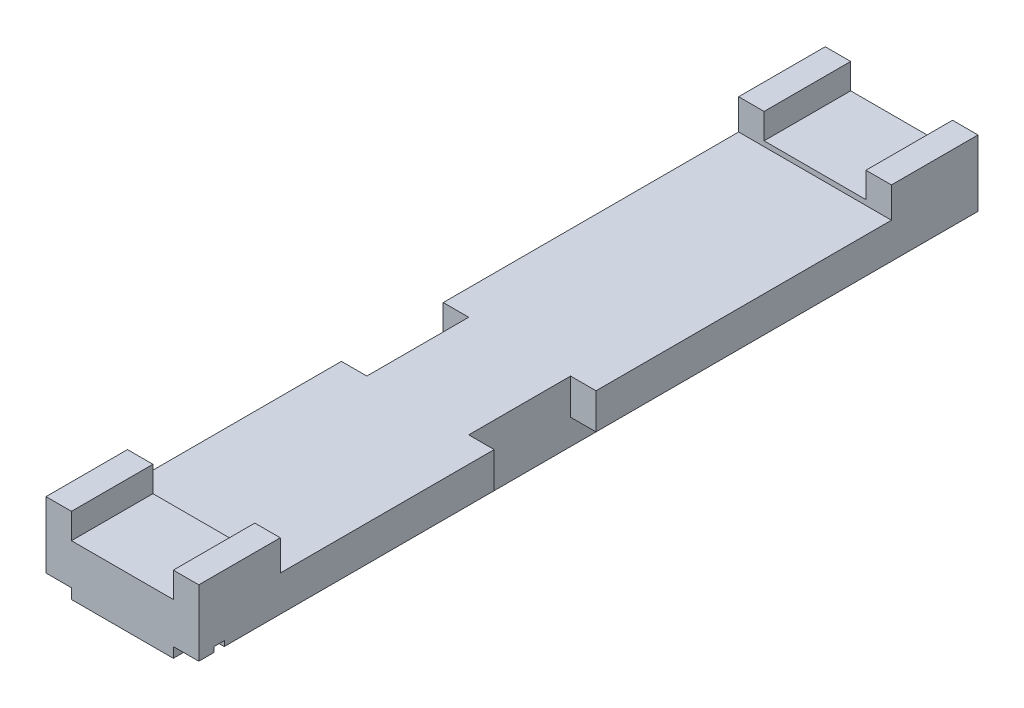
ISO-10303-21;
HEADER;
FILE_DESCRIPTION(('STEP AP214'),'2;1');
FILE_NAME('part.step','',(''),(''),'','','');
FILE_SCHEMA(('AUTOMOTIVE_DESIGN { 1 0 10303 214 1 1 1 1 }'));
ENDSEC;
DATA;
#1=APPLICATION_CONTEXT('core data for automotive mechanical design processes');
#2=APPLICATION_PROTOCOL_DEFINITION('international standard','automotive_design',2000,#1);
#3=PRODUCT_CONTEXT('',#1,'mechanical');
#4=PRODUCT('Part','Part','',(#3));
#5=PRODUCT_RELATED_PRODUCT_CATEGORY('part','',(#4));
#6=PRODUCT_DEFINITION_FORMATION('','',#4);
#7=PRODUCT_DEFINITION_CONTEXT('part definition',#1,'design');
#8=PRODUCT_DEFINITION('design','',#6,#7);
#9=PRODUCT_DEFINITION_SHAPE('','',#8);
#10=(LENGTH_UNIT() NAMED_UNIT(*) SI_UNIT(.MILLI.,.METRE.));
#11=(NAMED_UNIT(*) PLANE_ANGLE_UNIT() SI_UNIT($,.RADIAN.));
#12=(NAMED_UNIT(*) SI_UNIT($,.STERADIAN.) SOLID_ANGLE_UNIT());
#13=UNCERTAINTY_MEASURE_WITH_UNIT(LENGTH_MEASURE(1.E-05),#10,'distance_accuracy_value','');
#14=(GEOMETRIC_REPRESENTATION_CONTEXT(3) GLOBAL_UNCERTAINTY_ASSIGNED_CONTEXT((#13)) GLOBAL_UNIT_ASSIGNED_CONTEXT((#10,
#11,#12)) REPRESENTATION_CONTEXT('',''));
#15=CARTESIAN_POINT('',(0.,0.,0.));
#16=DIRECTION('',(0.,0.,1.));
#17=DIRECTION('',(1.,0.,0.));
#18=AXIS2_PLACEMENT_3D('',#15,#16,#17);
#19=CARTESIAN_POINT('',(-1.5,0.299999999999998,0.));
#20=DIRECTION('',(0.,1.,0.));
#21=DIRECTION('',(0.,0.,1.));
#22=AXIS2_PLACEMENT_3D('',#19,#20,#21);
#23=PLANE('',#22);
#24=DIRECTION('',(0.,0.,-1.));
#25=VECTOR('',#24,1.);
#26=CARTESIAN_POINT('',(-1.,0.299999999999998,0.));
#27=LINE('',#26,#25);
#28=CARTESIAN_POINT('',(-1.,0.299999999999998,0.));
#29=VERTEX_POINT('',#28);
#30=CARTESIAN_POINT('',(-0.999999999999999,0.299999999999998,-0.3));
#31=VERTEX_POINT('',#30);
#32=EDGE_CURVE('E412',#29,#31,#27,.T.);
#33=ORIENTED_EDGE('',*,*,#32,.T.);
#34=DIRECTION('',(1.,0.,0.));
#35=VECTOR('',#34,1.);
#36=CARTESIAN_POINT('',(-1.5,0.299999999999998,-0.3));
#37=LINE('',#36,#35);
#38=CARTESIAN_POINT('',(0.999999999999999,0.299999999999998,-0.3));
#39=VERTEX_POINT('',#38);
#40=EDGE_CURVE('E311',#31,#39,#37,.T.);
#41=ORIENTED_EDGE('',*,*,#40,.T.);
#42=DIRECTION('',(0.,0.,1.));
#43=VECTOR('',#42,1.);
#44=CARTESIAN_POINT('',(1.,0.299999999999998,0.));
#45=LINE('',#44,#43);
#46=CARTESIAN_POINT('',(1.,0.299999999999998,0.));
#47=VERTEX_POINT('',#46);
#48=EDGE_CURVE('E378',#39,#47,#45,.T.);
#49=ORIENTED_EDGE('',*,*,#48,.T.);
#50=DIRECTION('',(1.,0.,0.));
#51=VECTOR('',#50,1.);
#52=CARTESIAN_POINT('',(-1.5,0.299999999999998,0.));
#53=LINE('',#52,#51);
#54=EDGE_CURVE('E506',#29,#47,#53,.T.);
#55=ORIENTED_EDGE('',*,*,#54,.F.);
#56=EDGE_LOOP('',(#33,#41,#49,#55));
#57=FACE_BOUND('',#56,.T.);
#58=ADVANCED_FACE('F36',(#57),#23,.F.);
#59=CARTESIAN_POINT('',(-1.,0.,-7.8));
#60=DIRECTION('',(1.,0.,0.));
#61=DIRECTION('',(0.,0.,-1.));
#62=AXIS2_PLACEMENT_3D('',#59,#60,#61);
#63=PLANE('',#62);
#64=DIRECTION('',(0.,0.,1.));
#65=VECTOR('',#64,1.);
#66=CARTESIAN_POINT('',(-1.,0.5,-15.3));
#67=LINE('',#66,#65);
#68=CARTESIAN_POINT('',(-1.,0.5,-0.3));
#69=VERTEX_POINT('',#68);
#70=CARTESIAN_POINT('',(-1.,0.5,0.));
#71=VERTEX_POINT('',#70);
#72=EDGE_CURVE('E390',#69,#71,#67,.T.);
#73=ORIENTED_EDGE('',*,*,#72,.F.);
#74=DIRECTION('',(0.,-1.,0.));
#75=VECTOR('',#74,1.);
#76=CARTESIAN_POINT('',(-0.999999999999999,0.,-0.3));
#77=LINE('',#76,#75);
#78=EDGE_CURVE('E341',#69,#31,#77,.T.);
#79=ORIENTED_EDGE('',*,*,#78,.T.);
#80=ORIENTED_EDGE('',*,*,#32,.F.);
#81=DIRECTION('',(0.,1.,0.));
#82=VECTOR('',#81,1.);
#83=CARTESIAN_POINT('',(-1.,0.,0.));
#84=LINE('',#83,#82);
#85=EDGE_CURVE('E382',#29,#71,#84,.T.);
#86=ORIENTED_EDGE('',*,*,#85,.T.);
#87=EDGE_LOOP('',(#73,#79,#80,#86));
#88=FACE_BOUND('',#87,.T.);
#89=ADVANCED_FACE('F614',(#88),#63,.F.);
#90=CARTESIAN_POINT('',(1.,0.,-7.8));
#91=DIRECTION('',(-1.,0.,0.));
#92=DIRECTION('',(0.,0.,1.));
#93=AXIS2_PLACEMENT_3D('',#90,#91,#92);
#94=PLANE('',#93);
#95=ORIENTED_EDGE('',*,*,#48,.F.);
#96=DIRECTION('',(0.,1.,0.));
#97=VECTOR('',#96,1.);
#98=CARTESIAN_POINT('',(0.999999999999999,0.,-0.3));
#99=LINE('',#98,#97);
#100=CARTESIAN_POINT('',(1.,0.5,-0.3));
#101=VERTEX_POINT('',#100);
#102=EDGE_CURVE('E335',#39,#101,#99,.T.);
#103=ORIENTED_EDGE('',*,*,#102,.T.);
#104=DIRECTION('',(0.,0.,1.));
#105=VECTOR('',#104,1.);
#106=CARTESIAN_POINT('',(1.,0.5,-15.3));
#107=LINE('',#106,#105);
#108=CARTESIAN_POINT('',(1.,0.5,0.));
#109=VERTEX_POINT('',#108);
#110=EDGE_CURVE('E362',#101,#109,#107,.T.);
#111=ORIENTED_EDGE('',*,*,#110,.T.);
#112=DIRECTION('',(0.,-1.,0.));
#113=VECTOR('',#112,1.);
#114=CARTESIAN_POINT('',(1.,0.,0.));
#115=LINE('',#114,#113);
#116=EDGE_CURVE('E349',#109,#47,#115,.T.);
#117=ORIENTED_EDGE('',*,*,#116,.T.);
#118=EDGE_LOOP('',(#95,#103,#111,#117));
#119=FACE_BOUND('',#118,.T.);
#120=ADVANCED_FACE('F597',(#119),#94,.F.);
#121=CARTESIAN_POINT('',(-1.5,0.5,-15.3));
#122=DIRECTION('',(0.,1.,0.));
#123=DIRECTION('',(0.,0.,1.));
#124=AXIS2_PLACEMENT_3D('',#121,#122,#123);
#125=PLANE('',#124);
#126=DIRECTION('',(0.,0.,1.));
#127=VECTOR('',#126,1.);
#128=CARTESIAN_POINT('',(-1.5,0.5,-15.3));
#129=LINE('',#128,#127);
#130=CARTESIAN_POINT('',(-1.5,0.5,-0.3));
#131=VERTEX_POINT('',#130);
#132=CARTESIAN_POINT('',(-1.5,0.5,0.));
#133=VERTEX_POINT('',#132);
#134=EDGE_CURVE('E399',#131,#133,#129,.T.);
#135=ORIENTED_EDGE('',*,*,#134,.F.);
#136=DIRECTION('',(1.,0.,0.));
#137=VECTOR('',#136,1.);
#138=CARTESIAN_POINT('',(-1.5,0.5,-0.3));
#139=LINE('',#138,#137);
#140=EDGE_CURVE('E338',#131,#69,#139,.T.);
#141=ORIENTED_EDGE('',*,*,#140,.T.);
#142=ORIENTED_EDGE('',*,*,#72,.T.);
#143=DIRECTION('',(-1.,0.,0.));
#144=VECTOR('',#143,1.);
#145=CARTESIAN_POINT('',(-1.5,0.5,0.));
#146=LINE('',#145,#144);
#147=EDGE_CURVE('E387',#71,#133,#146,.T.);
#148=ORIENTED_EDGE('',*,*,#147,.T.);
#149=EDGE_LOOP('',(#135,#141,#142,#148));
#150=FACE_BOUND('',#149,.T.);
#151=ADVANCED_FACE('F671',(#150),#125,.F.);
#152=CARTESIAN_POINT('',(1.5,0.5,-15.3));
#153=DIRECTION('',(0.,1.,0.));
#154=DIRECTION('',(0.,0.,1.));
#155=AXIS2_PLACEMENT_3D('',#152,#153,#154);
#156=PLANE('',#155);
#157=ORIENTED_EDGE('',*,*,#110,.F.);
#158=DIRECTION('',(1.,0.,0.));
#159=VECTOR('',#158,1.);
#160=CARTESIAN_POINT('',(1.5,0.5,-0.3));
#161=LINE('',#160,#159);
#162=CARTESIAN_POINT('',(1.5,0.5,-0.3));
#163=VERTEX_POINT('',#162);
#164=EDGE_CURVE('E11',#101,#163,#161,.T.);
#165=ORIENTED_EDGE('',*,*,#164,.T.);
#166=DIRECTION('',(0.,0.,1.));
#167=VECTOR('',#166,1.);
#168=CARTESIAN_POINT('',(1.5,0.5,-15.3));
#169=LINE('',#168,#167);
#170=CARTESIAN_POINT('',(1.5,0.5,0.));
#171=VERTEX_POINT('',#170);
#172=EDGE_CURVE('E352',#163,#171,#169,.T.);
#173=ORIENTED_EDGE('',*,*,#172,.T.);
#174=DIRECTION('',(-1.,0.,0.));
#175=VECTOR('',#174,1.);
#176=CARTESIAN_POINT('',(1.5,0.5,0.));
#177=LINE('',#176,#175);
#178=EDGE_CURVE('E344',#171,#109,#177,.T.);
#179=ORIENTED_EDGE('',*,*,#178,.T.);
#180=EDGE_LOOP('',(#157,#165,#173,#179));
#181=FACE_BOUND('',#180,.T.);
#182=ADVANCED_FACE('F601',(#181),#156,.F.);
#183=CARTESIAN_POINT('',(0.,1.8,0.));
#184=DIRECTION('',(0.,-1.,0.));
#185=DIRECTION('',(0.,0.,-1.));
#186=AXIS2_PLACEMENT_3D('',#183,#184,#185);
#187=PLANE('',#186);
#188=DIRECTION('',(1.,0.,0.));
#189=VECTOR('',#188,1.);
#190=CARTESIAN_POINT('',(-1.5,1.8,0.));
#191=LINE('',#190,#189);
#192=CARTESIAN_POINT('',(-1.5,1.8,0.));
#193=VERTEX_POINT('',#192);
#194=CARTESIAN_POINT('',(-1.,1.8,0.));
#195=VERTEX_POINT('',#194);
#196=EDGE_CURVE('E560',#193,#195,#191,.T.);
#197=ORIENTED_EDGE('',*,*,#196,.T.);
#198=DIRECTION('',(0.,0.,1.));
#199=VECTOR('',#198,1.);
#200=CARTESIAN_POINT('',(-1.,1.8,-15.3));
#201=LINE('',#200,#199);
#202=CARTESIAN_POINT('',(-1.,1.8,-1.6));
#203=VERTEX_POINT('',#202);
#204=EDGE_CURVE('E439',#203,#195,#201,.T.);
#205=ORIENTED_EDGE('',*,*,#204,.F.);
#206=DIRECTION('',(1.,0.,0.));
#207=VECTOR('',#206,1.);
#208=CARTESIAN_POINT('',(-1.5,1.8,-1.6));
#209=LINE('',#208,#207);
#210=CARTESIAN_POINT('',(-1.5,1.8,-1.6));
#211=VERTEX_POINT('',#210);
#212=EDGE_CURVE('E535',#211,#203,#209,.T.);
#213=ORIENTED_EDGE('',*,*,#212,.F.);
#214=DIRECTION('',(0.,0.,-1.));
#215=VECTOR('',#214,1.);
#216=CARTESIAN_POINT('',(-1.5,1.8,0.));
#217=LINE('',#216,#215);
#218=EDGE_CURVE('E548',#193,#211,#217,.T.);
#219=ORIENTED_EDGE('',*,*,#218,.F.);
#220=EDGE_LOOP('',(#197,#205,#213,#219));
#221=FACE_BOUND('',#220,.T.);
#222=ADVANCED_FACE('F677',(#221),#187,.F.);
#223=DIRECTION('',(1.,0.,0.));
#224=VECTOR('',#223,1.);
#225=CARTESIAN_POINT('',(-1.5,1.8,-13.6));
#226=LINE('',#225,#224);
#227=CARTESIAN_POINT('',(-1.5,1.8,-13.6));
#228=VERTEX_POINT('',#227);
#229=CARTESIAN_POINT('',(-1.,1.8,-13.6));
#230=VERTEX_POINT('',#229);
#231=EDGE_CURVE('E540',#228,#230,#226,.T.);
#232=ORIENTED_EDGE('',*,*,#231,.T.);
#233=CARTESIAN_POINT('',(-1.,1.8,-15.3));
#234=VERTEX_POINT('',#233);
#235=EDGE_CURVE('E436',#234,#230,#201,.T.);
#236=ORIENTED_EDGE('',*,*,#235,.F.);
#237=DIRECTION('',(1.,0.,0.));
#238=VECTOR('',#237,1.);
#239=CARTESIAN_POINT('',(-1.5,1.8,-15.3));
#240=LINE('',#239,#238);
#241=CARTESIAN_POINT('',(-1.5,1.8,-15.3));
#242=VERTEX_POINT('',#241);
#243=EDGE_CURVE('E552',#242,#234,#240,.T.);
#244=ORIENTED_EDGE('',*,*,#243,.F.);
#245=EDGE_CURVE('E538',#228,#242,#217,.T.);
#246=ORIENTED_EDGE('',*,*,#245,.F.);
#247=EDGE_LOOP('',(#232,#236,#244,#246));
#248=FACE_BOUND('',#247,.T.);
#249=ADVANCED_FACE('F703',(#248),#187,.F.);
#250=CARTESIAN_POINT('',(1.5,1.8,0.));
#251=DIRECTION('',(-1.,0.,0.));
#252=DIRECTION('',(0.,0.,1.));
#253=AXIS2_PLACEMENT_3D('',#250,#251,#252);
#254=PLANE('',#253);
#255=DIRECTION('',(0.,1.,0.));
#256=VECTOR('',#255,1.);
#257=CARTESIAN_POINT('',(1.5,0.,-7.8));
#258=LINE('',#257,#256);
#259=CARTESIAN_POINT('',(1.5,0.5,-7.8));
#260=VERTEX_POINT('',#259);
#261=CARTESIAN_POINT('',(1.5,1.2,-7.8));
#262=VERTEX_POINT('',#261);
#263=EDGE_CURVE('E470',#260,#262,#258,.T.);
#264=ORIENTED_EDGE('',*,*,#263,.F.);
#265=CARTESIAN_POINT('',(1.5,0.5,-15.3));
#266=VERTEX_POINT('',#265);
#267=EDGE_CURVE('E59',#266,#260,#169,.T.);
#268=ORIENTED_EDGE('',*,*,#267,.F.);
#269=DIRECTION('',(0.,-1.,0.));
#270=VECTOR('',#269,1.);
#271=CARTESIAN_POINT('',(1.5,1.8,-15.3));
#272=LINE('',#271,#270);
#273=CARTESIAN_POINT('',(1.5,1.8,-15.3));
#274=VERTEX_POINT('',#273);
#275=EDGE_CURVE('E571',#274,#266,#272,.T.);
#276=ORIENTED_EDGE('',*,*,#275,.F.);
#277=DIRECTION('',(0.,0.,-1.));
#278=VECTOR('',#277,1.);
#279=CARTESIAN_POINT('',(1.5,1.8,0.));
#280=LINE('',#279,#278);
#281=CARTESIAN_POINT('',(1.5,1.8,-13.6));
#282=VERTEX_POINT('',#281);
#283=EDGE_CURVE('E555',#282,#274,#280,.T.);
#284=ORIENTED_EDGE('',*,*,#283,.F.);
#285=DIRECTION('',(0.,1.,0.));
#286=VECTOR('',#285,1.);
#287=CARTESIAN_POINT('',(1.5,1.8,-13.6));
#288=LINE('',#287,#286);
#289=CARTESIAN_POINT('',(1.5,1.2,-13.6));
#290=VERTEX_POINT('',#289);
#291=EDGE_CURVE('E519',#290,#282,#288,.T.);
#292=ORIENTED_EDGE('',*,*,#291,.F.);
#293=DIRECTION('',(0.,0.,-1.));
#294=VECTOR('',#293,1.);
#295=CARTESIAN_POINT('',(1.5,1.2,-1.6));
#296=LINE('',#295,#294);
#297=EDGE_CURVE('E529',#262,#290,#296,.T.);
#298=ORIENTED_EDGE('',*,*,#297,.F.);
#299=EDGE_LOOP('',(#264,#268,#276,#284,#292,#298));
#300=FACE_BOUND('',#299,.T.);
#301=ADVANCED_FACE('F650',(#300),#254,.F.);
#302=CARTESIAN_POINT('',(-1.5,1.8,0.));
#303=DIRECTION('',(-1.,0.,0.));
#304=DIRECTION('',(0.,0.,1.));
#305=AXIS2_PLACEMENT_3D('',#302,#303,#304);
#306=PLANE('',#305);
#307=CARTESIAN_POINT('',(-1.5,0.5,-15.3));
#308=VERTEX_POINT('',#307);
#309=CARTESIAN_POINT('',(-1.5,0.5,-7.8));
#310=VERTEX_POINT('',#309);
#311=EDGE_CURVE('E395',#308,#310,#129,.T.);
#312=ORIENTED_EDGE('',*,*,#311,.T.);
#313=DIRECTION('',(0.,1.,0.));
#314=VECTOR('',#313,1.);
#315=CARTESIAN_POINT('',(-1.5,0.,-7.8));
#316=LINE('',#315,#314);
#317=CARTESIAN_POINT('',(-1.5,1.2,-7.8));
#318=VERTEX_POINT('',#317);
#319=EDGE_CURVE('E489',#310,#318,#316,.T.);
#320=ORIENTED_EDGE('',*,*,#319,.T.);
#321=DIRECTION('',(0.,0.,-1.));
#322=VECTOR('',#321,1.);
#323=CARTESIAN_POINT('',(-1.5,1.2,-1.6));
#324=LINE('',#323,#322);
#325=CARTESIAN_POINT('',(-1.5,1.2,-13.6));
#326=VERTEX_POINT('',#325);
#327=EDGE_CURVE('E518',#318,#326,#324,.T.);
#328=ORIENTED_EDGE('',*,*,#327,.T.);
#329=DIRECTION('',(0.,1.,0.));
#330=VECTOR('',#329,1.);
#331=CARTESIAN_POINT('',(-1.5,1.8,-13.6));
#332=LINE('',#331,#330);
#333=EDGE_CURVE('E523',#326,#228,#332,.T.);
#334=ORIENTED_EDGE('',*,*,#333,.T.);
#335=ORIENTED_EDGE('',*,*,#245,.T.);
#336=DIRECTION('',(0.,-1.,0.));
#337=VECTOR('',#336,1.);
#338=CARTESIAN_POINT('',(-1.5,1.8,-15.3));
#339=LINE('',#338,#337);
#340=EDGE_CURVE('E563',#242,#308,#339,.T.);
#341=ORIENTED_EDGE('',*,*,#340,.T.);
#342=EDGE_LOOP('',(#312,#320,#328,#334,#335,#341));
#343=FACE_BOUND('',#342,.T.);
#344=ADVANCED_FACE('F697',(#343),#306,.T.);
#345=CARTESIAN_POINT('',(1.,1.8,-1.6));
#346=VERTEX_POINT('',#345);
#347=CARTESIAN_POINT('',(1.5,1.8,-1.6));
#348=VERTEX_POINT('',#347);
#349=EDGE_CURVE('E539',#346,#348,#209,.T.);
#350=ORIENTED_EDGE('',*,*,#349,.F.);
#351=DIRECTION('',(0.,0.,1.));
#352=VECTOR('',#351,1.);
#353=CARTESIAN_POINT('',(1.,1.8,-15.3));
#354=LINE('',#353,#352);
#355=CARTESIAN_POINT('',(1.,1.8,0.));
#356=VERTEX_POINT('',#355);
#357=EDGE_CURVE('E443',#346,#356,#354,.T.);
#358=ORIENTED_EDGE('',*,*,#357,.T.);
#359=CARTESIAN_POINT('',(1.5,1.8,0.));
#360=VERTEX_POINT('',#359);
#361=EDGE_CURVE('E559',#356,#360,#191,.T.);
#362=ORIENTED_EDGE('',*,*,#361,.T.);
#363=EDGE_CURVE('E556',#360,#348,#280,.T.);
#364=ORIENTED_EDGE('',*,*,#363,.T.);
#365=EDGE_LOOP('',(#350,#358,#362,#364));
#366=FACE_BOUND('',#365,.T.);
#367=ADVANCED_FACE('F723',(#366),#187,.F.);
#368=DIRECTION('',(0.,-1.,0.));
#369=VECTOR('',#368,1.);
#370=CARTESIAN_POINT('',(-1.5,0.599999999999998,-0.3));
#371=LINE('',#370,#369);
#372=CARTESIAN_POINT('',(-1.5,0.599999999999998,-0.3));
#373=VERTEX_POINT('',#372);
#374=EDGE_CURVE('E316',#373,#131,#371,.T.);
#375=ORIENTED_EDGE('',*,*,#374,.T.);
#376=ORIENTED_EDGE('',*,*,#134,.T.);
#377=DIRECTION('',(0.,-1.,0.));
#378=VECTOR('',#377,1.);
#379=CARTESIAN_POINT('',(-1.5,1.8,0.));
#380=LINE('',#379,#378);
#381=EDGE_CURVE('E564',#193,#133,#380,.T.);
#382=ORIENTED_EDGE('',*,*,#381,.F.);
#383=ORIENTED_EDGE('',*,*,#218,.T.);
#384=DIRECTION('',(0.,-1.,0.));
#385=VECTOR('',#384,1.);
#386=CARTESIAN_POINT('',(-1.5,1.8,-1.6));
#387=LINE('',#386,#385);
#388=CARTESIAN_POINT('',(-1.5,1.2,-1.6));
#389=VERTEX_POINT('',#388);
#390=EDGE_CURVE('E515',#211,#389,#387,.T.);
#391=ORIENTED_EDGE('',*,*,#390,.T.);
#392=CARTESIAN_POINT('',(-1.5,1.2,-5.8));
#393=VERTEX_POINT('',#392);
#394=EDGE_CURVE('E520',#389,#393,#324,.T.);
#395=ORIENTED_EDGE('',*,*,#394,.T.);
#396=DIRECTION('',(0.,1.,0.));
#397=VECTOR('',#396,1.);
#398=CARTESIAN_POINT('',(-1.5,0.,-5.8));
#399=LINE('',#398,#397);
#400=CARTESIAN_POINT('',(-1.5,0.5,-5.8));
#401=VERTEX_POINT('',#400);
#402=EDGE_CURVE('E480',#401,#393,#399,.T.);
#403=ORIENTED_EDGE('',*,*,#402,.F.);
#404=CARTESIAN_POINT('',(-1.5,0.5,-0.5));
#405=VERTEX_POINT('',#404);
#406=EDGE_CURVE('E315',#401,#405,#129,.T.);
#407=ORIENTED_EDGE('',*,*,#406,.T.);
#408=DIRECTION('',(0.,1.,0.));
#409=VECTOR('',#408,1.);
#410=CARTESIAN_POINT('',(-1.5,0.599999999999998,-0.5));
#411=LINE('',#410,#409);
#412=CARTESIAN_POINT('',(-1.5,0.599999999999998,-0.5));
#413=VERTEX_POINT('',#412);
#414=EDGE_CURVE('E295',#405,#413,#411,.T.);
#415=ORIENTED_EDGE('',*,*,#414,.T.);
#416=DIRECTION('',(0.,0.,1.));
#417=VECTOR('',#416,1.);
#418=CARTESIAN_POINT('',(-1.5,0.599999999999998,-0.3));
#419=LINE('',#418,#417);
#420=EDGE_CURVE('E306',#413,#373,#419,.T.);
#421=ORIENTED_EDGE('',*,*,#420,.T.);
#422=EDGE_LOOP('',(#375,#376,#382,#383,#391,#395,#403,#407,#415,#421));
#423=FACE_BOUND('',#422,.T.);
#424=ADVANCED_FACE('F38',(#423),#306,.T.);
#425=CARTESIAN_POINT('',(-1.5,1.8,0.));
#426=DIRECTION('',(0.,0.,-1.));
#427=DIRECTION('',(-1.,0.,0.));
#428=AXIS2_PLACEMENT_3D('',#425,#426,#427);
#429=PLANE('',#428);
#430=ORIENTED_EDGE('',*,*,#54,.T.);
#431=ORIENTED_EDGE('',*,*,#116,.F.);
#432=ORIENTED_EDGE('',*,*,#178,.F.);
#433=DIRECTION('',(0.,-1.,0.));
#434=VECTOR('',#433,1.);
#435=CARTESIAN_POINT('',(1.5,1.8,0.));
#436=LINE('',#435,#434);
#437=EDGE_CURVE('E568',#360,#171,#436,.T.);
#438=ORIENTED_EDGE('',*,*,#437,.F.);
#439=ORIENTED_EDGE('',*,*,#361,.F.);
#440=DIRECTION('',(0.,1.,0.));
#441=VECTOR('',#440,1.);
#442=CARTESIAN_POINT('',(1.,1.8,0.));
#443=LINE('',#442,#441);
#444=CARTESIAN_POINT('',(1.,1.3,0.));
#445=VERTEX_POINT('',#444);
#446=EDGE_CURVE('E423',#445,#356,#443,.T.);
#447=ORIENTED_EDGE('',*,*,#446,.F.);
#448=DIRECTION('',(1.,0.,0.));
#449=VECTOR('',#448,1.);
#450=CARTESIAN_POINT('',(-1.,1.3,0.));
#451=LINE('',#450,#449);
#452=CARTESIAN_POINT('',(-1.,1.3,0.));
#453=VERTEX_POINT('',#452);
#454=EDGE_CURVE('E432',#453,#445,#451,.T.);
#455=ORIENTED_EDGE('',*,*,#454,.F.);
#456=DIRECTION('',(0.,-1.,0.));
#457=VECTOR('',#456,1.);
#458=CARTESIAN_POINT('',(-1.,1.8,0.));
#459=LINE('',#458,#457);
#460=EDGE_CURVE('E418',#195,#453,#459,.T.);
#461=ORIENTED_EDGE('',*,*,#460,.F.);
#462=ORIENTED_EDGE('',*,*,#196,.F.);
#463=ORIENTED_EDGE('',*,*,#381,.T.);
#464=ORIENTED_EDGE('',*,*,#147,.F.);
#465=ORIENTED_EDGE('',*,*,#85,.F.);
#466=EDGE_LOOP('',(#430,#431,#432,#438,#439,#447,#455,#461,#462,#463,#464,#465));
#467=FACE_BOUND('',#466,.T.);
#468=ADVANCED_FACE('F605',(#467),#429,.F.);
#469=ORIENTED_EDGE('',*,*,#172,.F.);
#470=DIRECTION('',(0.,-1.,0.));
#471=VECTOR('',#470,1.);
#472=CARTESIAN_POINT('',(1.5,0.599999999999998,-0.3));
#473=LINE('',#472,#471);
#474=CARTESIAN_POINT('',(1.5,0.599999999999998,-0.3));
#475=VERTEX_POINT('',#474);
#476=EDGE_CURVE('E321',#475,#163,#473,.T.);
#477=ORIENTED_EDGE('',*,*,#476,.F.);
#478=DIRECTION('',(0.,0.,1.));
#479=VECTOR('',#478,1.);
#480=CARTESIAN_POINT('',(1.5,0.599999999999998,-0.3));
#481=LINE('',#480,#479);
#482=CARTESIAN_POINT('',(1.5,0.599999999999998,-0.5));
#483=VERTEX_POINT('',#482);
#484=EDGE_CURVE('E318',#483,#475,#481,.T.);
#485=ORIENTED_EDGE('',*,*,#484,.F.);
#486=DIRECTION('',(0.,1.,0.));
#487=VECTOR('',#486,1.);
#488=CARTESIAN_POINT('',(1.5,0.599999999999998,-0.5));
#489=LINE('',#488,#487);
#490=CARTESIAN_POINT('',(1.5,0.5,-0.5));
#491=VERTEX_POINT('',#490);
#492=EDGE_CURVE('E298',#491,#483,#489,.T.);
#493=ORIENTED_EDGE('',*,*,#492,.F.);
#494=CARTESIAN_POINT('',(1.5,0.5,-5.8));
#495=VERTEX_POINT('',#494);
#496=EDGE_CURVE('E364',#495,#491,#169,.T.);
#497=ORIENTED_EDGE('',*,*,#496,.F.);
#498=DIRECTION('',(0.,1.,0.));
#499=VECTOR('',#498,1.);
#500=CARTESIAN_POINT('',(1.5,0.,-5.8));
#501=LINE('',#500,#499);
#502=CARTESIAN_POINT('',(1.5,1.2,-5.8));
#503=VERTEX_POINT('',#502);
#504=EDGE_CURVE('E473',#495,#503,#501,.T.);
#505=ORIENTED_EDGE('',*,*,#504,.T.);
#506=CARTESIAN_POINT('',(1.5,1.2,-1.6));
#507=VERTEX_POINT('',#506);
#508=EDGE_CURVE('E530',#507,#503,#296,.T.);
#509=ORIENTED_EDGE('',*,*,#508,.F.);
#510=DIRECTION('',(0.,-1.,0.));
#511=VECTOR('',#510,1.);
#512=CARTESIAN_POINT('',(1.5,1.8,-1.6));
#513=LINE('',#512,#511);
#514=EDGE_CURVE('E509',#348,#507,#513,.T.);
#515=ORIENTED_EDGE('',*,*,#514,.F.);
#516=ORIENTED_EDGE('',*,*,#363,.F.);
#517=ORIENTED_EDGE('',*,*,#437,.T.);
#518=EDGE_LOOP('',(#469,#477,#485,#493,#497,#505,#509,#515,#516,#517));
#519=FACE_BOUND('',#518,.T.);
#520=ADVANCED_FACE('F668',(#519),#254,.F.);
#521=CARTESIAN_POINT('',(-1.5,1.8,-15.3));
#522=DIRECTION('',(0.,0.,-1.));
#523=DIRECTION('',(-1.,0.,0.));
#524=AXIS2_PLACEMENT_3D('',#521,#522,#523);
#525=PLANE('',#524);
#526=DIRECTION('',(0.,-1.,0.));
#527=VECTOR('',#526,1.);
#528=CARTESIAN_POINT('',(1.,0.,-15.3));
#529=LINE('',#528,#527);
#530=CARTESIAN_POINT('',(1.,0.5,-15.3));
#531=VERTEX_POINT('',#530);
#532=CARTESIAN_POINT('',(1.,0.3,-15.3));
#533=VERTEX_POINT('',#532);
#534=EDGE_CURVE('E348',#531,#533,#529,.T.);
#535=ORIENTED_EDGE('',*,*,#534,.T.);
#536=DIRECTION('',(1.,0.,0.));
#537=VECTOR('',#536,1.);
#538=CARTESIAN_POINT('',(-1.5,0.3,-15.3));
#539=LINE('',#538,#537);
#540=CARTESIAN_POINT('',(-1.,0.3,-15.3));
#541=VERTEX_POINT('',#540);
#542=EDGE_CURVE('E491',#541,#533,#539,.T.);
#543=ORIENTED_EDGE('',*,*,#542,.F.);
#544=DIRECTION('',(0.,1.,0.));
#545=VECTOR('',#544,1.);
#546=CARTESIAN_POINT('',(-1.,0.,-15.3));
#547=LINE('',#546,#545);
#548=CARTESIAN_POINT('',(-1.,0.5,-15.3));
#549=VERTEX_POINT('',#548);
#550=EDGE_CURVE('E383',#541,#549,#547,.T.);
#551=ORIENTED_EDGE('',*,*,#550,.T.);
#552=DIRECTION('',(-1.,0.,0.));
#553=VECTOR('',#552,1.);
#554=CARTESIAN_POINT('',(-1.5,0.5,-15.3));
#555=LINE('',#554,#553);
#556=EDGE_CURVE('E386',#549,#308,#555,.T.);
#557=ORIENTED_EDGE('',*,*,#556,.T.);
#558=ORIENTED_EDGE('',*,*,#340,.F.);
#559=ORIENTED_EDGE('',*,*,#243,.T.);
#560=DIRECTION('',(0.,-1.,0.));
#561=VECTOR('',#560,1.);
#562=CARTESIAN_POINT('',(-1.,1.8,-15.3));
#563=LINE('',#562,#561);
#564=CARTESIAN_POINT('',(-1.,1.3,-15.3));
#565=VERTEX_POINT('',#564);
#566=EDGE_CURVE('E419',#234,#565,#563,.T.);
#567=ORIENTED_EDGE('',*,*,#566,.T.);
#568=DIRECTION('',(1.,0.,0.));
#569=VECTOR('',#568,1.);
#570=CARTESIAN_POINT('',(-1.,1.3,-15.3));
#571=LINE('',#570,#569);
#572=CARTESIAN_POINT('',(1.,1.3,-15.3));
#573=VERTEX_POINT('',#572);
#574=EDGE_CURVE('E422',#565,#573,#571,.T.);
#575=ORIENTED_EDGE('',*,*,#574,.T.);
#576=DIRECTION('',(0.,1.,0.));
#577=VECTOR('',#576,1.);
#578=CARTESIAN_POINT('',(1.,1.8,-15.3));
#579=LINE('',#578,#577);
#580=CARTESIAN_POINT('',(1.,1.8,-15.3));
#581=VERTEX_POINT('',#580);
#582=EDGE_CURVE('E426',#573,#581,#579,.T.);
#583=ORIENTED_EDGE('',*,*,#582,.T.);
#584=EDGE_CURVE('E551',#581,#274,#240,.T.);
#585=ORIENTED_EDGE('',*,*,#584,.T.);
#586=ORIENTED_EDGE('',*,*,#275,.T.);
#587=DIRECTION('',(-1.,0.,0.));
#588=VECTOR('',#587,1.);
#589=CARTESIAN_POINT('',(1.5,0.5,-15.3));
#590=LINE('',#589,#588);
#591=EDGE_CURVE('E345',#266,#531,#590,.T.);
#592=ORIENTED_EDGE('',*,*,#591,.T.);
#593=EDGE_LOOP('',(#535,#543,#551,#557,#558,#559,#567,#575,#583,#585,#586,#592));
#594=FACE_BOUND('',#593,.T.);
#595=ADVANCED_FACE('F645',(#594),#525,.T.);
#596=ORIENTED_EDGE('',*,*,#584,.F.);
#597=CARTESIAN_POINT('',(1.,1.8,-13.6));
#598=VERTEX_POINT('',#597);
#599=EDGE_CURVE('E440',#581,#598,#354,.T.);
#600=ORIENTED_EDGE('',*,*,#599,.T.);
#601=EDGE_CURVE('E543',#598,#282,#226,.T.);
#602=ORIENTED_EDGE('',*,*,#601,.T.);
#603=ORIENTED_EDGE('',*,*,#283,.T.);
#604=EDGE_LOOP('',(#596,#600,#602,#603));
#605=FACE_BOUND('',#604,.T.);
#606=ADVANCED_FACE('F720',(#605),#187,.F.);
#607=CARTESIAN_POINT('',(0.,0.,0.));
#608=DIRECTION('',(0.,-1.,0.));
#609=DIRECTION('',(0.,0.,-1.));
#610=AXIS2_PLACEMENT_3D('',#607,#608,#609);
#611=PLANE('',#610);
#612=DIRECTION('',(0.,0.,1.));
#613=VECTOR('',#612,1.);
#614=CARTESIAN_POINT('',(1.,0.,-7.8));
#615=LINE('',#614,#613);
#616=CARTESIAN_POINT('',(1.,0.,-12.3));
#617=VERTEX_POINT('',#616);
#618=CARTESIAN_POINT('',(1.,0.,-2.3));
#619=VERTEX_POINT('',#618);
#620=EDGE_CURVE('E459',#617,#619,#615,.T.);
#621=ORIENTED_EDGE('',*,*,#620,.T.);
#622=DIRECTION('',(1.,0.,0.));
#623=VECTOR('',#622,1.);
#624=CARTESIAN_POINT('',(-1.5,0.,-2.3));
#625=LINE('',#624,#623);
#626=CARTESIAN_POINT('',(-1.,0.,-2.3));
#627=VERTEX_POINT('',#626);
#628=EDGE_CURVE('E500',#627,#619,#625,.T.);
#629=ORIENTED_EDGE('',*,*,#628,.F.);
#630=DIRECTION('',(0.,0.,-1.));
#631=VECTOR('',#630,1.);
#632=CARTESIAN_POINT('',(-1.,0.,-7.8));
#633=LINE('',#632,#631);
#634=CARTESIAN_POINT('',(-1.,0.,-12.3));
#635=VERTEX_POINT('',#634);
#636=EDGE_CURVE('E478',#627,#635,#633,.T.);
#637=ORIENTED_EDGE('',*,*,#636,.T.);
#638=DIRECTION('',(1.,0.,0.));
#639=VECTOR('',#638,1.);
#640=CARTESIAN_POINT('',(-1.5,0.,-12.3));
#641=LINE('',#640,#639);
#642=EDGE_CURVE('E497',#635,#617,#641,.T.);
#643=ORIENTED_EDGE('',*,*,#642,.T.);
#644=EDGE_LOOP('',(#621,#629,#637,#643));
#645=FACE_BOUND('',#644,.T.);
#646=ADVANCED_FACE('F634',(#645),#611,.T.);
#647=CARTESIAN_POINT('',(-1.5,1.8,-1.6));
#648=DIRECTION('',(0.,0.,1.));
#649=DIRECTION('',(1.,0.,0.));
#650=AXIS2_PLACEMENT_3D('',#647,#648,#649);
#651=PLANE('',#650);
#652=ORIENTED_EDGE('',*,*,#212,.T.);
#653=DIRECTION('',(0.,-1.,0.));
#654=VECTOR('',#653,1.);
#655=CARTESIAN_POINT('',(-1.,1.8,-1.6));
#656=LINE('',#655,#654);
#657=CARTESIAN_POINT('',(-1.,1.3,-1.6));
#658=VERTEX_POINT('',#657);
#659=EDGE_CURVE('E455',#203,#658,#656,.T.);
#660=ORIENTED_EDGE('',*,*,#659,.T.);
#661=DIRECTION('',(1.,0.,0.));
#662=VECTOR('',#661,1.);
#663=CARTESIAN_POINT('',(-1.5,1.3,-1.6));
#664=LINE('',#663,#662);
#665=CARTESIAN_POINT('',(1.,1.3,-1.6));
#666=VERTEX_POINT('',#665);
#667=EDGE_CURVE('E438',#658,#666,#664,.T.);
#668=ORIENTED_EDGE('',*,*,#667,.T.);
#669=DIRECTION('',(0.,1.,0.));
#670=VECTOR('',#669,1.);
#671=CARTESIAN_POINT('',(1.,1.8,-1.6));
#672=LINE('',#671,#670);
#673=EDGE_CURVE('E452',#666,#346,#672,.T.);
#674=ORIENTED_EDGE('',*,*,#673,.T.);
#675=ORIENTED_EDGE('',*,*,#349,.T.);
#676=ORIENTED_EDGE('',*,*,#514,.T.);
#677=DIRECTION('',(1.,0.,0.));
#678=VECTOR('',#677,1.);
#679=CARTESIAN_POINT('',(-1.5,1.2,-1.6));
#680=LINE('',#679,#678);
#681=EDGE_CURVE('E526',#389,#507,#680,.T.);
#682=ORIENTED_EDGE('',*,*,#681,.F.);
#683=ORIENTED_EDGE('',*,*,#390,.F.);
#684=EDGE_LOOP('',(#652,#660,#668,#674,#675,#676,#682,#683));
#685=FACE_BOUND('',#684,.T.);
#686=ADVANCED_FACE('F680',(#685),#651,.F.);
#687=CARTESIAN_POINT('',(-1.5,1.8,-13.6));
#688=DIRECTION('',(0.,0.,-1.));
#689=DIRECTION('',(-1.,0.,0.));
#690=AXIS2_PLACEMENT_3D('',#687,#688,#689);
#691=PLANE('',#690);
#692=DIRECTION('',(-1.,0.,0.));
#693=VECTOR('',#692,1.);
#694=CARTESIAN_POINT('',(-1.5,1.3,-13.6));
#695=LINE('',#694,#693);
#696=CARTESIAN_POINT('',(1.,1.3,-13.6));
#697=VERTEX_POINT('',#696);
#698=CARTESIAN_POINT('',(-1.,1.3,-13.6));
#699=VERTEX_POINT('',#698);
#700=EDGE_CURVE('E567',#697,#699,#695,.T.);
#701=ORIENTED_EDGE('',*,*,#700,.T.);
#702=DIRECTION('',(0.,1.,0.));
#703=VECTOR('',#702,1.);
#704=CARTESIAN_POINT('',(-1.,1.8,-13.6));
#705=LINE('',#704,#703);
#706=EDGE_CURVE('E581',#699,#230,#705,.T.);
#707=ORIENTED_EDGE('',*,*,#706,.T.);
#708=ORIENTED_EDGE('',*,*,#231,.F.);
#709=ORIENTED_EDGE('',*,*,#333,.F.);
#710=DIRECTION('',(1.,0.,0.));
#711=VECTOR('',#710,1.);
#712=CARTESIAN_POINT('',(-1.5,1.2,-13.6));
#713=LINE('',#712,#711);
#714=EDGE_CURVE('E544',#326,#290,#713,.T.);
#715=ORIENTED_EDGE('',*,*,#714,.T.);
#716=ORIENTED_EDGE('',*,*,#291,.T.);
#717=ORIENTED_EDGE('',*,*,#601,.F.);
#718=DIRECTION('',(0.,-1.,0.));
#719=VECTOR('',#718,1.);
#720=CARTESIAN_POINT('',(1.,1.8,-13.6));
#721=LINE('',#720,#719);
#722=EDGE_CURVE('E578',#598,#697,#721,.T.);
#723=ORIENTED_EDGE('',*,*,#722,.T.);
#724=EDGE_LOOP('',(#701,#707,#708,#709,#715,#716,#717,#723));
#725=FACE_BOUND('',#724,.T.);
#726=ADVANCED_FACE('F708',(#725),#691,.F.);
#727=CARTESIAN_POINT('',(-1.5,1.2,-1.6));
#728=DIRECTION('',(0.,-1.,0.));
#729=DIRECTION('',(0.,0.,-1.));
#730=AXIS2_PLACEMENT_3D('',#727,#728,#729);
#731=PLANE('',#730);
#732=DIRECTION('',(0.,0.,1.));
#733=VECTOR('',#732,1.);
#734=CARTESIAN_POINT('',(1.,1.2,-7.8));
#735=LINE('',#734,#733);
#736=CARTESIAN_POINT('',(1.,1.2,-7.8));
#737=VERTEX_POINT('',#736);
#738=CARTESIAN_POINT('',(1.,1.2,-5.8));
#739=VERTEX_POINT('',#738);
#740=EDGE_CURVE('E465',#737,#739,#735,.T.);
#741=ORIENTED_EDGE('',*,*,#740,.F.);
#742=DIRECTION('',(-1.,0.,0.));
#743=VECTOR('',#742,1.);
#744=CARTESIAN_POINT('',(1.5,1.2,-7.8));
#745=LINE('',#744,#743);
#746=EDGE_CURVE('E458',#262,#737,#745,.T.);
#747=ORIENTED_EDGE('',*,*,#746,.F.);
#748=ORIENTED_EDGE('',*,*,#297,.T.);
#749=ORIENTED_EDGE('',*,*,#714,.F.);
#750=ORIENTED_EDGE('',*,*,#327,.F.);
#751=DIRECTION('',(-1.,0.,0.));
#752=VECTOR('',#751,1.);
#753=CARTESIAN_POINT('',(-1.5,1.2,-7.8));
#754=LINE('',#753,#752);
#755=CARTESIAN_POINT('',(-1.,1.2,-7.8));
#756=VERTEX_POINT('',#755);
#757=EDGE_CURVE('E481',#756,#318,#754,.T.);
#758=ORIENTED_EDGE('',*,*,#757,.F.);
#759=DIRECTION('',(0.,0.,-1.));
#760=VECTOR('',#759,1.);
#761=CARTESIAN_POINT('',(-1.,1.2,-7.8));
#762=LINE('',#761,#760);
#763=CARTESIAN_POINT('',(-1.,1.2,-5.8));
#764=VERTEX_POINT('',#763);
#765=EDGE_CURVE('E484',#764,#756,#762,.T.);
#766=ORIENTED_EDGE('',*,*,#765,.F.);
#767=DIRECTION('',(1.,0.,0.));
#768=VECTOR('',#767,1.);
#769=CARTESIAN_POINT('',(-1.5,1.2,-5.8));
#770=LINE('',#769,#768);
#771=EDGE_CURVE('E472',#393,#764,#770,.T.);
#772=ORIENTED_EDGE('',*,*,#771,.F.);
#773=ORIENTED_EDGE('',*,*,#394,.F.);
#774=ORIENTED_EDGE('',*,*,#681,.T.);
#775=ORIENTED_EDGE('',*,*,#508,.T.);
#776=DIRECTION('',(1.,0.,0.));
#777=VECTOR('',#776,1.);
#778=CARTESIAN_POINT('',(1.5,1.2,-5.8));
#779=LINE('',#778,#777);
#780=EDGE_CURVE('E462',#739,#503,#779,.T.);
#781=ORIENTED_EDGE('',*,*,#780,.F.);
#782=EDGE_LOOP('',(#741,#747,#748,#749,#750,#758,#766,#772,#773,#774,#775,#781));
#783=FACE_BOUND('',#782,.T.);
#784=ADVANCED_FACE('F660',(#783),#731,.F.);
#785=CARTESIAN_POINT('',(1.,0.299999999999998,-2.3));
#786=VERTEX_POINT('',#785);
#787=CARTESIAN_POINT('',(0.999999999999999,0.299999999999998,-0.5));
#788=VERTEX_POINT('',#787);
#789=EDGE_CURVE('E379',#786,#788,#45,.T.);
#790=ORIENTED_EDGE('',*,*,#789,.T.);
#791=DIRECTION('',(1.,0.,0.));
#792=VECTOR('',#791,1.);
#793=CARTESIAN_POINT('',(-1.5,0.299999999999998,-0.5));
#794=LINE('',#793,#792);
#795=CARTESIAN_POINT('',(-0.999999999999999,0.299999999999998,-0.5));
#796=VERTEX_POINT('',#795);
#797=EDGE_CURVE('E303',#796,#788,#794,.T.);
#798=ORIENTED_EDGE('',*,*,#797,.F.);
#799=CARTESIAN_POINT('',(-1.,0.299999999999998,-2.3));
#800=VERTEX_POINT('',#799);
#801=EDGE_CURVE('E411',#796,#800,#27,.T.);
#802=ORIENTED_EDGE('',*,*,#801,.T.);
#803=DIRECTION('',(1.,0.,0.));
#804=VECTOR('',#803,1.);
#805=CARTESIAN_POINT('',(-1.5,0.299999999999998,-2.3));
#806=LINE('',#805,#804);
#807=EDGE_CURVE('E510',#800,#786,#806,.T.);
#808=ORIENTED_EDGE('',*,*,#807,.T.);
#809=EDGE_LOOP('',(#790,#798,#802,#808));
#810=FACE_BOUND('',#809,.T.);
#811=ADVANCED_FACE('F627',(#810),#23,.F.);
#812=CARTESIAN_POINT('',(-1.5,0.299999999999998,-2.3));
#813=DIRECTION('',(0.,0.,-1.));
#814=DIRECTION('',(-1.,0.,0.));
#815=AXIS2_PLACEMENT_3D('',#812,#813,#814);
#816=PLANE('',#815);
#817=ORIENTED_EDGE('',*,*,#628,.T.);
#818=DIRECTION('',(0.,1.,0.));
#819=VECTOR('',#818,1.);
#820=CARTESIAN_POINT('',(1.,0.299999999999998,-2.3));
#821=LINE('',#820,#819);
#822=EDGE_CURVE('E375',#619,#786,#821,.T.);
#823=ORIENTED_EDGE('',*,*,#822,.T.);
#824=ORIENTED_EDGE('',*,*,#807,.F.);
#825=DIRECTION('',(0.,-1.,0.));
#826=VECTOR('',#825,1.);
#827=CARTESIAN_POINT('',(-1.,0.299999999999998,-2.3));
#828=LINE('',#827,#826);
#829=EDGE_CURVE('E408',#800,#627,#828,.T.);
#830=ORIENTED_EDGE('',*,*,#829,.T.);
#831=EDGE_LOOP('',(#817,#823,#824,#830));
#832=FACE_BOUND('',#831,.T.);
#833=ADVANCED_FACE('F631',(#832),#816,.F.);
#834=CARTESIAN_POINT('',(-1.5,0.,-12.3));
#835=DIRECTION('',(0.,0.,1.));
#836=DIRECTION('',(1.,0.,0.));
#837=AXIS2_PLACEMENT_3D('',#834,#835,#836);
#838=PLANE('',#837);
#839=DIRECTION('',(1.,0.,0.));
#840=VECTOR('',#839,1.);
#841=CARTESIAN_POINT('',(-1.5,0.3,-12.3));
#842=LINE('',#841,#840);
#843=CARTESIAN_POINT('',(-1.,0.3,-12.3));
#844=VERTEX_POINT('',#843);
#845=CARTESIAN_POINT('',(1.,0.3,-12.3));
#846=VERTEX_POINT('',#845);
#847=EDGE_CURVE('E501',#844,#846,#842,.T.);
#848=ORIENTED_EDGE('',*,*,#847,.T.);
#849=DIRECTION('',(0.,-1.,0.));
#850=VECTOR('',#849,1.);
#851=CARTESIAN_POINT('',(1.,0.,-12.3));
#852=LINE('',#851,#850);
#853=EDGE_CURVE('E372',#846,#617,#852,.T.);
#854=ORIENTED_EDGE('',*,*,#853,.T.);
#855=ORIENTED_EDGE('',*,*,#642,.F.);
#856=DIRECTION('',(0.,1.,0.));
#857=VECTOR('',#856,1.);
#858=CARTESIAN_POINT('',(-1.,0.,-12.3));
#859=LINE('',#858,#857);
#860=EDGE_CURVE('E405',#635,#844,#859,.T.);
#861=ORIENTED_EDGE('',*,*,#860,.T.);
#862=EDGE_LOOP('',(#848,#854,#855,#861));
#863=FACE_BOUND('',#862,.T.);
#864=ADVANCED_FACE('F638',(#863),#838,.F.);
#865=CARTESIAN_POINT('',(-1.5,0.3,-15.3));
#866=DIRECTION('',(0.,1.,0.));
#867=DIRECTION('',(0.,0.,1.));
#868=AXIS2_PLACEMENT_3D('',#865,#866,#867);
#869=PLANE('',#868);
#870=ORIENTED_EDGE('',*,*,#542,.T.);
#871=DIRECTION('',(0.,0.,1.));
#872=VECTOR('',#871,1.);
#873=CARTESIAN_POINT('',(1.,0.3,-15.3));
#874=LINE('',#873,#872);
#875=EDGE_CURVE('E369',#533,#846,#874,.T.);
#876=ORIENTED_EDGE('',*,*,#875,.T.);
#877=ORIENTED_EDGE('',*,*,#847,.F.);
#878=DIRECTION('',(0.,0.,-1.));
#879=VECTOR('',#878,1.);
#880=CARTESIAN_POINT('',(-1.,0.3,-15.3));
#881=LINE('',#880,#879);
#882=EDGE_CURVE('E398',#844,#541,#881,.T.);
#883=ORIENTED_EDGE('',*,*,#882,.T.);
#884=EDGE_LOOP('',(#870,#876,#877,#883));
#885=FACE_BOUND('',#884,.T.);
#886=ADVANCED_FACE('F641',(#885),#869,.F.);
#887=CARTESIAN_POINT('',(-1.5,0.,-7.8));
#888=DIRECTION('',(0.,0.,-1.));
#889=DIRECTION('',(-1.,0.,0.));
#890=AXIS2_PLACEMENT_3D('',#887,#888,#889);
#891=PLANE('',#890);
#892=ORIENTED_EDGE('',*,*,#319,.F.);
#893=DIRECTION('',(1.,0.,0.));
#894=VECTOR('',#893,1.);
#895=CARTESIAN_POINT('',(-1.5,0.5,-7.8));
#896=LINE('',#895,#894);
#897=CARTESIAN_POINT('',(-1.,0.5,-7.8));
#898=VERTEX_POINT('',#897);
#899=EDGE_CURVE('E415',#310,#898,#896,.T.);
#900=ORIENTED_EDGE('',*,*,#899,.T.);
#901=DIRECTION('',(0.,1.,0.));
#902=VECTOR('',#901,1.);
#903=CARTESIAN_POINT('',(-1.,0.,-7.8));
#904=LINE('',#903,#902);
#905=EDGE_CURVE('E492',#898,#756,#904,.T.);
#906=ORIENTED_EDGE('',*,*,#905,.T.);
#907=ORIENTED_EDGE('',*,*,#757,.T.);
#908=EDGE_LOOP('',(#892,#900,#906,#907));
#909=FACE_BOUND('',#908,.T.);
#910=ADVANCED_FACE('F693',(#909),#891,.F.);
#911=ORIENTED_EDGE('',*,*,#801,.F.);
#912=DIRECTION('',(0.,1.,0.));
#913=VECTOR('',#912,1.);
#914=CARTESIAN_POINT('',(-0.999999999999999,0.,-0.5));
#915=LINE('',#914,#913);
#916=CARTESIAN_POINT('',(-1.,0.5,-0.5));
#917=VERTEX_POINT('',#916);
#918=EDGE_CURVE('E332',#796,#917,#915,.T.);
#919=ORIENTED_EDGE('',*,*,#918,.T.);
#920=CARTESIAN_POINT('',(-1.,0.5,-5.8));
#921=VERTEX_POINT('',#920);
#922=EDGE_CURVE('E402',#921,#917,#67,.T.);
#923=ORIENTED_EDGE('',*,*,#922,.F.);
#924=DIRECTION('',(0.,1.,0.));
#925=VECTOR('',#924,1.);
#926=CARTESIAN_POINT('',(-1.,0.,-5.8));
#927=LINE('',#926,#925);
#928=EDGE_CURVE('E494',#921,#764,#927,.T.);
#929=ORIENTED_EDGE('',*,*,#928,.T.);
#930=ORIENTED_EDGE('',*,*,#765,.T.);
#931=ORIENTED_EDGE('',*,*,#905,.F.);
#932=EDGE_CURVE('E400',#549,#898,#67,.T.);
#933=ORIENTED_EDGE('',*,*,#932,.F.);
#934=ORIENTED_EDGE('',*,*,#550,.F.);
#935=ORIENTED_EDGE('',*,*,#882,.F.);
#936=ORIENTED_EDGE('',*,*,#860,.F.);
#937=ORIENTED_EDGE('',*,*,#636,.F.);
#938=ORIENTED_EDGE('',*,*,#829,.F.);
#939=EDGE_LOOP('',(#911,#919,#923,#929,#930,#931,#933,#934,#935,#936,#937,#938));
#940=FACE_BOUND('',#939,.T.);
#941=ADVANCED_FACE('F623',(#940),#63,.F.);
#942=CARTESIAN_POINT('',(-1.5,0.,-5.8));
#943=DIRECTION('',(0.,0.,1.));
#944=DIRECTION('',(1.,0.,0.));
#945=AXIS2_PLACEMENT_3D('',#942,#943,#944);
#946=PLANE('',#945);
#947=ORIENTED_EDGE('',*,*,#928,.F.);
#948=DIRECTION('',(-1.,0.,0.));
#949=VECTOR('',#948,1.);
#950=CARTESIAN_POINT('',(-1.5,0.5,-5.8));
#951=LINE('',#950,#949);
#952=EDGE_CURVE('E584',#921,#401,#951,.T.);
#953=ORIENTED_EDGE('',*,*,#952,.T.);
#954=ORIENTED_EDGE('',*,*,#402,.T.);
#955=ORIENTED_EDGE('',*,*,#771,.T.);
#956=EDGE_LOOP('',(#947,#953,#954,#955));
#957=FACE_BOUND('',#956,.T.);
#958=ADVANCED_FACE('F686',(#957),#946,.F.);
#959=CARTESIAN_POINT('',(1.5,0.,-7.8));
#960=DIRECTION('',(0.,0.,-1.));
#961=DIRECTION('',(-1.,0.,0.));
#962=AXIS2_PLACEMENT_3D('',#959,#960,#961);
#963=PLANE('',#962);
#964=DIRECTION('',(0.,1.,0.));
#965=VECTOR('',#964,1.);
#966=CARTESIAN_POINT('',(1.,0.,-7.8));
#967=LINE('',#966,#965);
#968=CARTESIAN_POINT('',(1.,0.5,-7.8));
#969=VERTEX_POINT('',#968);
#970=EDGE_CURVE('E461',#969,#737,#967,.T.);
#971=ORIENTED_EDGE('',*,*,#970,.F.);
#972=DIRECTION('',(1.,0.,0.));
#973=VECTOR('',#972,1.);
#974=CARTESIAN_POINT('',(1.5,0.5,-7.8));
#975=LINE('',#974,#973);
#976=EDGE_CURVE('E367',#969,#260,#975,.T.);
#977=ORIENTED_EDGE('',*,*,#976,.T.);
#978=ORIENTED_EDGE('',*,*,#263,.T.);
#979=ORIENTED_EDGE('',*,*,#746,.T.);
#980=EDGE_LOOP('',(#971,#977,#978,#979));
#981=FACE_BOUND('',#980,.T.);
#982=ADVANCED_FACE('F657',(#981),#963,.F.);
#983=CARTESIAN_POINT('',(1.5,0.,-5.8));
#984=DIRECTION('',(0.,0.,1.));
#985=DIRECTION('',(1.,0.,0.));
#986=AXIS2_PLACEMENT_3D('',#983,#984,#985);
#987=PLANE('',#986);
#988=ORIENTED_EDGE('',*,*,#504,.F.);
#989=DIRECTION('',(-1.,0.,0.));
#990=VECTOR('',#989,1.);
#991=CARTESIAN_POINT('',(1.5,0.5,-5.8));
#992=LINE('',#991,#990);
#993=CARTESIAN_POINT('',(1.,0.5,-5.8));
#994=VERTEX_POINT('',#993);
#995=EDGE_CURVE('E360',#495,#994,#992,.T.);
#996=ORIENTED_EDGE('',*,*,#995,.T.);
#997=DIRECTION('',(0.,1.,0.));
#998=VECTOR('',#997,1.);
#999=CARTESIAN_POINT('',(1.,0.,-5.8));
#1000=LINE('',#999,#998);
#1001=EDGE_CURVE('E475',#994,#739,#1000,.T.);
#1002=ORIENTED_EDGE('',*,*,#1001,.T.);
#1003=ORIENTED_EDGE('',*,*,#780,.T.);
#1004=EDGE_LOOP('',(#988,#996,#1002,#1003));
#1005=FACE_BOUND('',#1004,.T.);
#1006=ADVANCED_FACE('F666',(#1005),#987,.F.);
#1007=CARTESIAN_POINT('',(1.,0.5,-0.5));
#1008=VERTEX_POINT('',#1007);
#1009=EDGE_CURVE('E361',#994,#1008,#107,.T.);
#1010=ORIENTED_EDGE('',*,*,#1009,.T.);
#1011=DIRECTION('',(0.,-1.,0.));
#1012=VECTOR('',#1011,1.);
#1013=CARTESIAN_POINT('',(0.999999999999999,0.,-0.5));
#1014=LINE('',#1013,#1012);
#1015=EDGE_CURVE('E51',#1008,#788,#1014,.T.);
#1016=ORIENTED_EDGE('',*,*,#1015,.T.);
#1017=ORIENTED_EDGE('',*,*,#789,.F.);
#1018=ORIENTED_EDGE('',*,*,#822,.F.);
#1019=ORIENTED_EDGE('',*,*,#620,.F.);
#1020=ORIENTED_EDGE('',*,*,#853,.F.);
#1021=ORIENTED_EDGE('',*,*,#875,.F.);
#1022=ORIENTED_EDGE('',*,*,#534,.F.);
#1023=EDGE_CURVE('E357',#531,#969,#107,.T.);
#1024=ORIENTED_EDGE('',*,*,#1023,.T.);
#1025=ORIENTED_EDGE('',*,*,#970,.T.);
#1026=ORIENTED_EDGE('',*,*,#740,.T.);
#1027=ORIENTED_EDGE('',*,*,#1001,.F.);
#1028=EDGE_LOOP('',(#1010,#1016,#1017,#1018,#1019,#1020,#1021,#1022,#1024,#1025,#1026,#1027));
#1029=FACE_BOUND('',#1028,.T.);
#1030=ADVANCED_FACE('F593',(#1029),#94,.F.);
#1031=CARTESIAN_POINT('',(-1.,1.3,-15.3));
#1032=DIRECTION('',(0.,-1.,0.));
#1033=DIRECTION('',(0.,0.,-1.));
#1034=AXIS2_PLACEMENT_3D('',#1031,#1032,#1033);
#1035=PLANE('',#1034);
#1036=DIRECTION('',(0.,0.,1.));
#1037=VECTOR('',#1036,1.);
#1038=CARTESIAN_POINT('',(1.,1.3,-15.3));
#1039=LINE('',#1038,#1037);
#1040=EDGE_CURVE('E444',#573,#697,#1039,.T.);
#1041=ORIENTED_EDGE('',*,*,#1040,.F.);
#1042=ORIENTED_EDGE('',*,*,#574,.F.);
#1043=DIRECTION('',(0.,0.,1.));
#1044=VECTOR('',#1043,1.);
#1045=CARTESIAN_POINT('',(-1.,1.3,-15.3));
#1046=LINE('',#1045,#1044);
#1047=EDGE_CURVE('E448',#565,#699,#1046,.T.);
#1048=ORIENTED_EDGE('',*,*,#1047,.T.);
#1049=ORIENTED_EDGE('',*,*,#700,.F.);
#1050=EDGE_LOOP('',(#1041,#1042,#1048,#1049));
#1051=FACE_BOUND('',#1050,.T.);
#1052=ADVANCED_FACE('F712',(#1051),#1035,.F.);
#1053=CARTESIAN_POINT('',(1.,1.8,-15.3));
#1054=DIRECTION('',(1.,0.,0.));
#1055=DIRECTION('',(0.,0.,-1.));
#1056=AXIS2_PLACEMENT_3D('',#1053,#1054,#1055);
#1057=PLANE('',#1056);
#1058=ORIENTED_EDGE('',*,*,#599,.F.);
#1059=ORIENTED_EDGE('',*,*,#582,.F.);
#1060=ORIENTED_EDGE('',*,*,#1040,.T.);
#1061=ORIENTED_EDGE('',*,*,#722,.F.);
#1062=EDGE_LOOP('',(#1058,#1059,#1060,#1061));
#1063=FACE_BOUND('',#1062,.T.);
#1064=ADVANCED_FACE('F716',(#1063),#1057,.F.);
#1065=CARTESIAN_POINT('',(-1.,1.8,-15.3));
#1066=DIRECTION('',(-1.,0.,0.));
#1067=DIRECTION('',(0.,0.,1.));
#1068=AXIS2_PLACEMENT_3D('',#1065,#1066,#1067);
#1069=PLANE('',#1068);
#1070=ORIENTED_EDGE('',*,*,#1047,.F.);
#1071=ORIENTED_EDGE('',*,*,#566,.F.);
#1072=ORIENTED_EDGE('',*,*,#235,.T.);
#1073=ORIENTED_EDGE('',*,*,#706,.F.);
#1074=EDGE_LOOP('',(#1070,#1071,#1072,#1073));
#1075=FACE_BOUND('',#1074,.T.);
#1076=ADVANCED_FACE('F706',(#1075),#1069,.F.);
#1077=ORIENTED_EDGE('',*,*,#204,.T.);
#1078=ORIENTED_EDGE('',*,*,#460,.T.);
#1079=EDGE_CURVE('E429',#658,#453,#1046,.T.);
#1080=ORIENTED_EDGE('',*,*,#1079,.F.);
#1081=ORIENTED_EDGE('',*,*,#659,.F.);
#1082=EDGE_LOOP('',(#1077,#1078,#1080,#1081));
#1083=FACE_BOUND('',#1082,.T.);
#1084=ADVANCED_FACE('F790',(#1083),#1069,.F.);
#1085=EDGE_CURVE('E447',#666,#445,#1039,.T.);
#1086=ORIENTED_EDGE('',*,*,#1085,.T.);
#1087=ORIENTED_EDGE('',*,*,#446,.T.);
#1088=ORIENTED_EDGE('',*,*,#357,.F.);
#1089=ORIENTED_EDGE('',*,*,#673,.F.);
#1090=EDGE_LOOP('',(#1086,#1087,#1088,#1089));
#1091=FACE_BOUND('',#1090,.T.);
#1092=ADVANCED_FACE('F782',(#1091),#1057,.F.);
#1093=ORIENTED_EDGE('',*,*,#1079,.T.);
#1094=ORIENTED_EDGE('',*,*,#454,.T.);
#1095=ORIENTED_EDGE('',*,*,#1085,.F.);
#1096=ORIENTED_EDGE('',*,*,#667,.F.);
#1097=EDGE_LOOP('',(#1093,#1094,#1095,#1096));
#1098=FACE_BOUND('',#1097,.T.);
#1099=ADVANCED_FACE('F771',(#1098),#1035,.F.);
#1100=ORIENTED_EDGE('',*,*,#922,.T.);
#1101=DIRECTION('',(-1.,0.,0.));
#1102=VECTOR('',#1101,1.);
#1103=CARTESIAN_POINT('',(-1.5,0.5,-0.5));
#1104=LINE('',#1103,#1102);
#1105=EDGE_CURVE('E330',#917,#405,#1104,.T.);
#1106=ORIENTED_EDGE('',*,*,#1105,.T.);
#1107=ORIENTED_EDGE('',*,*,#406,.F.);
#1108=ORIENTED_EDGE('',*,*,#952,.F.);
#1109=EDGE_LOOP('',(#1100,#1106,#1107,#1108));
#1110=FACE_BOUND('',#1109,.T.);
#1111=ADVANCED_FACE('F619',(#1110),#125,.F.);
#1112=ORIENTED_EDGE('',*,*,#311,.F.);
#1113=ORIENTED_EDGE('',*,*,#556,.F.);
#1114=ORIENTED_EDGE('',*,*,#932,.T.);
#1115=ORIENTED_EDGE('',*,*,#899,.F.);
#1116=EDGE_LOOP('',(#1112,#1113,#1114,#1115));
#1117=FACE_BOUND('',#1116,.T.);
#1118=ADVANCED_FACE('F695',(#1117),#125,.F.);
#1119=ORIENTED_EDGE('',*,*,#496,.T.);
#1120=DIRECTION('',(-1.,0.,0.));
#1121=VECTOR('',#1120,1.);
#1122=CARTESIAN_POINT('',(1.5,0.5,-0.5));
#1123=LINE('',#1122,#1121);
#1124=EDGE_CURVE('E44',#491,#1008,#1123,.T.);
#1125=ORIENTED_EDGE('',*,*,#1124,.T.);
#1126=ORIENTED_EDGE('',*,*,#1009,.F.);
#1127=ORIENTED_EDGE('',*,*,#995,.F.);
#1128=EDGE_LOOP('',(#1119,#1125,#1126,#1127));
#1129=FACE_BOUND('',#1128,.T.);
#1130=ADVANCED_FACE('F589',(#1129),#156,.F.);
#1131=ORIENTED_EDGE('',*,*,#1023,.F.);
#1132=ORIENTED_EDGE('',*,*,#591,.F.);
#1133=ORIENTED_EDGE('',*,*,#267,.T.);
#1134=ORIENTED_EDGE('',*,*,#976,.F.);
#1135=EDGE_LOOP('',(#1131,#1132,#1133,#1134));
#1136=FACE_BOUND('',#1135,.T.);
#1137=ADVANCED_FACE('F647',(#1136),#156,.F.);
#1138=CARTESIAN_POINT('',(-1.5,0.599999999999998,-0.3));
#1139=DIRECTION('',(0.,0.,1.));
#1140=DIRECTION('',(1.,0.,0.));
#1141=AXIS2_PLACEMENT_3D('',#1138,#1139,#1140);
#1142=PLANE('',#1141);
#1143=ORIENTED_EDGE('',*,*,#140,.F.);
#1144=ORIENTED_EDGE('',*,*,#374,.F.);
#1145=DIRECTION('',(1.,0.,0.));
#1146=VECTOR('',#1145,1.);
#1147=CARTESIAN_POINT('',(-1.5,0.599999999999998,-0.3));
#1148=LINE('',#1147,#1146);
#1149=EDGE_CURVE('E302',#373,#475,#1148,.T.);
#1150=ORIENTED_EDGE('',*,*,#1149,.T.);
#1151=ORIENTED_EDGE('',*,*,#476,.T.);
#1152=ORIENTED_EDGE('',*,*,#164,.F.);
#1153=ORIENTED_EDGE('',*,*,#102,.F.);
#1154=ORIENTED_EDGE('',*,*,#40,.F.);
#1155=ORIENTED_EDGE('',*,*,#78,.F.);
#1156=EDGE_LOOP('',(#1143,#1144,#1150,#1151,#1152,#1153,#1154,#1155));
#1157=FACE_BOUND('',#1156,.T.);
#1158=ADVANCED_FACE('F611',(#1157),#1142,.F.);
#1159=CARTESIAN_POINT('',(-1.5,0.599999999999998,-0.5));
#1160=DIRECTION('',(0.,0.,-1.));
#1161=DIRECTION('',(-1.,0.,0.));
#1162=AXIS2_PLACEMENT_3D('',#1159,#1160,#1161);
#1163=PLANE('',#1162);
#1164=ORIENTED_EDGE('',*,*,#797,.T.);
#1165=ORIENTED_EDGE('',*,*,#1015,.F.);
#1166=ORIENTED_EDGE('',*,*,#1124,.F.);
#1167=ORIENTED_EDGE('',*,*,#492,.T.);
#1168=DIRECTION('',(1.,0.,0.));
#1169=VECTOR('',#1168,1.);
#1170=CARTESIAN_POINT('',(-1.5,0.599999999999998,-0.5));
#1171=LINE('',#1170,#1169);
#1172=EDGE_CURVE('E291',#413,#483,#1171,.T.);
#1173=ORIENTED_EDGE('',*,*,#1172,.F.);
#1174=ORIENTED_EDGE('',*,*,#414,.F.);
#1175=ORIENTED_EDGE('',*,*,#1105,.F.);
#1176=ORIENTED_EDGE('',*,*,#918,.F.);
#1177=EDGE_LOOP('',(#1164,#1165,#1166,#1167,#1173,#1174,#1175,#1176));
#1178=FACE_BOUND('',#1177,.T.);
#1179=ADVANCED_FACE('F293',(#1178),#1163,.F.);
#1180=CARTESIAN_POINT('',(-1.5,0.599999999999998,-0.3));
#1181=DIRECTION('',(0.,1.,0.));
#1182=DIRECTION('',(0.,0.,1.));
#1183=AXIS2_PLACEMENT_3D('',#1180,#1181,#1182);
#1184=PLANE('',#1183);
#1185=ORIENTED_EDGE('',*,*,#484,.T.);
#1186=ORIENTED_EDGE('',*,*,#1149,.F.);
#1187=ORIENTED_EDGE('',*,*,#420,.F.);
#1188=ORIENTED_EDGE('',*,*,#1172,.T.);
#1189=EDGE_LOOP('',(#1185,#1186,#1187,#1188));
#1190=FACE_BOUND('',#1189,.T.);
#1191=ADVANCED_FACE('F307',(#1190),#1184,.F.);
#1192=CLOSED_SHELL('',(#58,#89,#120,#151,#182,#222,#249,#301,#344,#367,#424,#468,#520,#595,#606,
#646,#686,#726,#784,#811,#833,#864,#886,#910,#941,#958,#982,#1006,#1030,#1052,#1064,#1076,#1084,
#1092,#1099,#1111,#1118,#1130,#1137,#1158,#1179,#1191));
#1193=MANIFOLD_SOLID_BREP('B2',#1192);
#1194=ADVANCED_BREP_SHAPE_REPRESENTATION('',(#18,#1193),#14);
#1195=SHAPE_DEFINITION_REPRESENTATION(#9,#1194);
ENDSEC;
END-ISO-10303-21;
